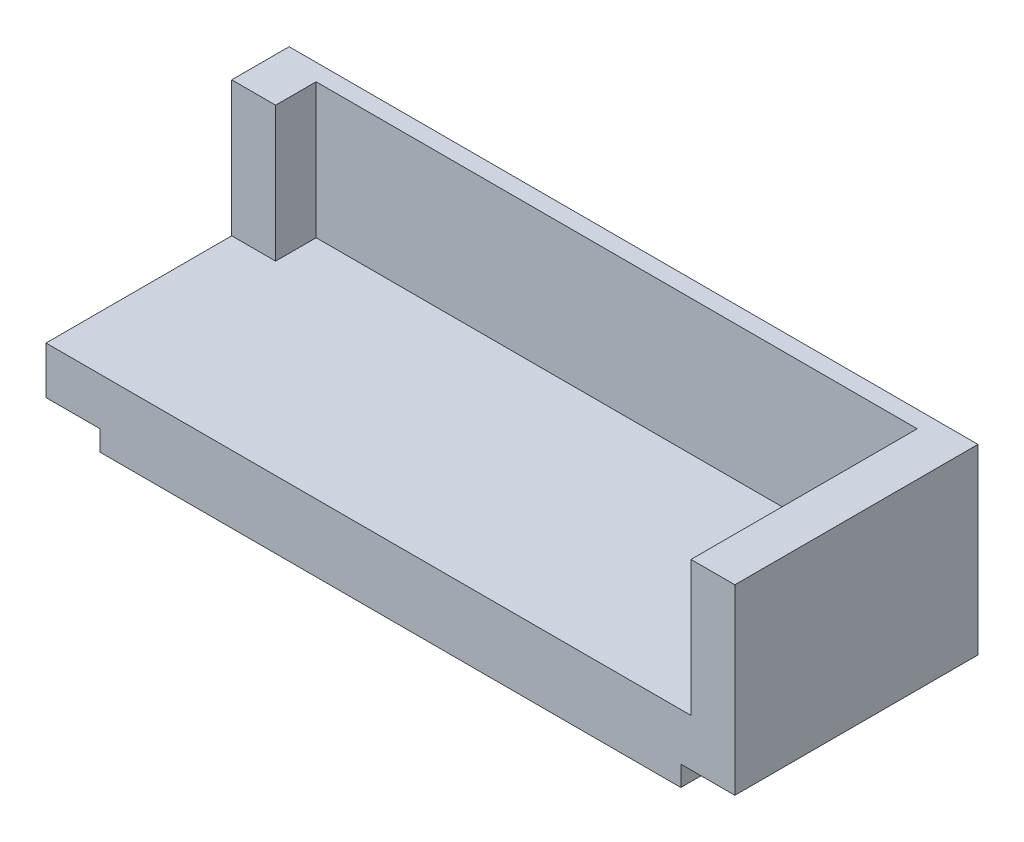
ISO-10303-21;
HEADER;
FILE_DESCRIPTION(('STEP AP214'),'2;1');
FILE_NAME('part.step','',(''),(''),'','','');
FILE_SCHEMA(('AUTOMOTIVE_DESIGN { 1 0 10303 214 1 1 1 1 }'));
ENDSEC;
DATA;
#1=APPLICATION_CONTEXT('core data for automotive mechanical design processes');
#2=APPLICATION_PROTOCOL_DEFINITION('international standard','automotive_design',2000,#1);
#3=PRODUCT_CONTEXT('',#1,'mechanical');
#4=PRODUCT('Part','Part','',(#3));
#5=PRODUCT_RELATED_PRODUCT_CATEGORY('part','',(#4));
#6=PRODUCT_DEFINITION_FORMATION('','',#4);
#7=PRODUCT_DEFINITION_CONTEXT('part definition',#1,'design');
#8=PRODUCT_DEFINITION('design','',#6,#7);
#9=PRODUCT_DEFINITION_SHAPE('','',#8);
#10=(LENGTH_UNIT() NAMED_UNIT(*) SI_UNIT(.MILLI.,.METRE.));
#11=(NAMED_UNIT(*) PLANE_ANGLE_UNIT() SI_UNIT($,.RADIAN.));
#12=(NAMED_UNIT(*) SI_UNIT($,.STERADIAN.) SOLID_ANGLE_UNIT());
#13=UNCERTAINTY_MEASURE_WITH_UNIT(LENGTH_MEASURE(1.E-05),#10,'distance_accuracy_value','');
#14=(GEOMETRIC_REPRESENTATION_CONTEXT(3) GLOBAL_UNCERTAINTY_ASSIGNED_CONTEXT((#13)) GLOBAL_UNIT_ASSIGNED_CONTEXT((#10,
#11,#12)) REPRESENTATION_CONTEXT('',''));
#15=CARTESIAN_POINT('',(0.,0.,0.));
#16=DIRECTION('',(0.,0.,1.));
#17=DIRECTION('',(1.,0.,0.));
#18=AXIS2_PLACEMENT_3D('',#15,#16,#17);
#19=CARTESIAN_POINT('',(0.,3.5,0.));
#20=DIRECTION('',(0.,-1.,0.));
#21=DIRECTION('',(0.,0.,-1.));
#22=AXIS2_PLACEMENT_3D('',#19,#20,#21);
#23=PLANE('',#22);
#24=DIRECTION('',(1.,0.,0.));
#25=VECTOR('',#24,1.);
#26=CARTESIAN_POINT('',(-4.,3.5,-13.75));
#27=LINE('',#26,#25);
#28=CARTESIAN_POINT('',(-4.,3.5,-13.75));
#29=VERTEX_POINT('',#28);
#30=CARTESIAN_POINT('',(-0.75,3.5,-13.75));
#31=VERTEX_POINT('',#30);
#32=EDGE_CURVE('E259',#29,#31,#27,.T.);
#33=ORIENTED_EDGE('',*,*,#32,.F.);
#34=DIRECTION('',(0.,0.,-1.));
#35=VECTOR('',#34,1.);
#36=CARTESIAN_POINT('',(-4.,3.5,0.));
#37=LINE('',#36,#35);
#38=CARTESIAN_POINT('',(-4.,3.5,0.));
#39=VERTEX_POINT('',#38);
#40=EDGE_CURVE('E153',#39,#29,#37,.T.);
#41=ORIENTED_EDGE('',*,*,#40,.F.);
#42=DIRECTION('',(1.,0.,0.));
#43=VECTOR('',#42,1.);
#44=CARTESIAN_POINT('',(43.,3.5,0.));
#45=LINE('',#44,#43);
#46=CARTESIAN_POINT('',(43.75,3.5,0.));
#47=VERTEX_POINT('',#46);
#48=EDGE_CURVE('E208',#39,#47,#45,.T.);
#49=ORIENTED_EDGE('',*,*,#48,.T.);
#50=DIRECTION('',(0.,0.,1.));
#51=VECTOR('',#50,1.);
#52=CARTESIAN_POINT('',(43.75,3.5,-16.75));
#53=LINE('',#52,#51);
#54=CARTESIAN_POINT('',(43.75,3.5,-16.75));
#55=VERTEX_POINT('',#54);
#56=EDGE_CURVE('E154',#55,#47,#53,.T.);
#57=ORIENTED_EDGE('',*,*,#56,.F.);
#58=DIRECTION('',(1.,0.,0.));
#59=VECTOR('',#58,1.);
#60=CARTESIAN_POINT('',(-4.,3.5,-16.75));
#61=LINE('',#60,#59);
#62=CARTESIAN_POINT('',(-0.75,3.5,-16.75));
#63=VERTEX_POINT('',#62);
#64=EDGE_CURVE('E171',#63,#55,#61,.T.);
#65=ORIENTED_EDGE('',*,*,#64,.F.);
#66=DIRECTION('',(0.,0.,-1.));
#67=VECTOR('',#66,1.);
#68=CARTESIAN_POINT('',(-0.75,3.5,-16.75));
#69=LINE('',#68,#67);
#70=EDGE_CURVE('E147',#31,#63,#69,.T.);
#71=ORIENTED_EDGE('',*,*,#70,.F.);
#72=EDGE_LOOP('',(#33,#41,#49,#57,#65,#71));
#73=FACE_BOUND('',#72,.T.);
#74=ADVANCED_FACE('F32',(#73),#23,.F.);
#75=CARTESIAN_POINT('',(-4.,13.5,-16.75));
#76=DIRECTION('',(0.,0.,-1.));
#77=DIRECTION('',(-1.,0.,0.));
#78=AXIS2_PLACEMENT_3D('',#75,#76,#77);
#79=PLANE('',#78);
#80=DIRECTION('',(0.,-1.,0.));
#81=VECTOR('',#80,1.);
#82=CARTESIAN_POINT('',(-0.75,13.5,-16.75));
#83=LINE('',#82,#81);
#84=CARTESIAN_POINT('',(-0.75,13.5,-16.75));
#85=VERTEX_POINT('',#84);
#86=EDGE_CURVE('E49',#85,#63,#83,.T.);
#87=ORIENTED_EDGE('',*,*,#86,.T.);
#88=ORIENTED_EDGE('',*,*,#64,.T.);
#89=DIRECTION('',(0.,-1.,0.));
#90=VECTOR('',#89,1.);
#91=CARTESIAN_POINT('',(43.75,13.5,-16.75));
#92=LINE('',#91,#90);
#93=CARTESIAN_POINT('',(43.75,13.5,-16.75));
#94=VERTEX_POINT('',#93);
#95=EDGE_CURVE('E168',#94,#55,#92,.T.);
#96=ORIENTED_EDGE('',*,*,#95,.F.);
#97=DIRECTION('',(1.,0.,0.));
#98=VECTOR('',#97,1.);
#99=CARTESIAN_POINT('',(-4.,13.5,-16.75));
#100=LINE('',#99,#98);
#101=EDGE_CURVE('E172',#85,#94,#100,.T.);
#102=ORIENTED_EDGE('',*,*,#101,.F.);
#103=EDGE_LOOP('',(#87,#88,#96,#102));
#104=FACE_BOUND('',#103,.T.);
#105=ADVANCED_FACE('F266',(#104),#79,.F.);
#106=CARTESIAN_POINT('',(0.,-1.5,-18.));
#107=DIRECTION('',(-1.,0.,0.));
#108=DIRECTION('',(0.,0.,1.));
#109=AXIS2_PLACEMENT_3D('',#106,#107,#108);
#110=PLANE('',#109);
#111=DIRECTION('',(0.,0.,1.));
#112=VECTOR('',#111,1.);
#113=CARTESIAN_POINT('',(0.,0.,0.));
#114=LINE('',#113,#112);
#115=CARTESIAN_POINT('',(0.,0.,-18.));
#116=VERTEX_POINT('',#115);
#117=CARTESIAN_POINT('',(0.,0.,0.));
#118=VERTEX_POINT('',#117);
#119=EDGE_CURVE('E57',#116,#118,#114,.T.);
#120=ORIENTED_EDGE('',*,*,#119,.F.);
#121=DIRECTION('',(0.,1.,0.));
#122=VECTOR('',#121,1.);
#123=CARTESIAN_POINT('',(0.,-1.5,-18.));
#124=LINE('',#123,#122);
#125=CARTESIAN_POINT('',(0.,-1.5,-18.));
#126=VERTEX_POINT('',#125);
#127=EDGE_CURVE('E11',#126,#116,#124,.T.);
#128=ORIENTED_EDGE('',*,*,#127,.F.);
#129=DIRECTION('',(0.,0.,1.));
#130=VECTOR('',#129,1.);
#131=CARTESIAN_POINT('',(0.,-1.5,-18.));
#132=LINE('',#131,#130);
#133=CARTESIAN_POINT('',(0.,-1.5,0.));
#134=VERTEX_POINT('',#133);
#135=EDGE_CURVE('E211',#126,#134,#132,.T.);
#136=ORIENTED_EDGE('',*,*,#135,.T.);
#137=DIRECTION('',(0.,1.,0.));
#138=VECTOR('',#137,1.);
#139=CARTESIAN_POINT('',(0.,-1.5,0.));
#140=LINE('',#139,#138);
#141=EDGE_CURVE('E36',#134,#118,#140,.T.);
#142=ORIENTED_EDGE('',*,*,#141,.T.);
#143=EDGE_LOOP('',(#120,#128,#136,#142));
#144=FACE_BOUND('',#143,.T.);
#145=ADVANCED_FACE('F34',(#144),#110,.T.);
#146=CARTESIAN_POINT('',(43.,-1.5,-18.));
#147=DIRECTION('',(0.,0.,-1.));
#148=DIRECTION('',(-1.,0.,0.));
#149=AXIS2_PLACEMENT_3D('',#146,#147,#148);
#150=PLANE('',#149);
#151=ORIENTED_EDGE('',*,*,#127,.T.);
#152=DIRECTION('',(1.,0.,0.));
#153=VECTOR('',#152,1.);
#154=CARTESIAN_POINT('',(-4.,0.,-18.));
#155=LINE('',#154,#153);
#156=CARTESIAN_POINT('',(-4.,0.,-18.));
#157=VERTEX_POINT('',#156);
#158=EDGE_CURVE('E189',#157,#116,#155,.T.);
#159=ORIENTED_EDGE('',*,*,#158,.F.);
#160=DIRECTION('',(0.,-1.,0.));
#161=VECTOR('',#160,1.);
#162=CARTESIAN_POINT('',(-4.,0.,-18.));
#163=LINE('',#162,#161);
#164=CARTESIAN_POINT('',(-4.,13.5,-18.));
#165=VERTEX_POINT('',#164);
#166=EDGE_CURVE('E181',#165,#157,#163,.T.);
#167=ORIENTED_EDGE('',*,*,#166,.F.);
#168=DIRECTION('',(-1.,0.,0.));
#169=VECTOR('',#168,1.);
#170=CARTESIAN_POINT('',(-4.,13.5,-18.));
#171=LINE('',#170,#169);
#172=CARTESIAN_POINT('',(47.,13.5,-18.));
#173=VERTEX_POINT('',#172);
#174=EDGE_CURVE('E136',#173,#165,#171,.T.);
#175=ORIENTED_EDGE('',*,*,#174,.F.);
#176=DIRECTION('',(0.,1.,0.));
#177=VECTOR('',#176,1.);
#178=CARTESIAN_POINT('',(47.,0.,-18.));
#179=LINE('',#178,#177);
#180=CARTESIAN_POINT('',(47.,0.,-18.));
#181=VERTEX_POINT('',#180);
#182=EDGE_CURVE('E198',#181,#173,#179,.T.);
#183=ORIENTED_EDGE('',*,*,#182,.F.);
#184=DIRECTION('',(-1.,0.,0.));
#185=VECTOR('',#184,1.);
#186=CARTESIAN_POINT('',(47.,0.,-18.));
#187=LINE('',#186,#185);
#188=CARTESIAN_POINT('',(43.,0.,-18.));
#189=VERTEX_POINT('',#188);
#190=EDGE_CURVE('E200',#181,#189,#187,.T.);
#191=ORIENTED_EDGE('',*,*,#190,.T.);
#192=DIRECTION('',(0.,1.,0.));
#193=VECTOR('',#192,1.);
#194=CARTESIAN_POINT('',(43.,-1.5,-18.));
#195=LINE('',#194,#193);
#196=CARTESIAN_POINT('',(43.,-1.5,-18.));
#197=VERTEX_POINT('',#196);
#198=EDGE_CURVE('E41',#197,#189,#195,.T.);
#199=ORIENTED_EDGE('',*,*,#198,.F.);
#200=DIRECTION('',(-1.,0.,0.));
#201=VECTOR('',#200,1.);
#202=CARTESIAN_POINT('',(43.,-1.5,-18.));
#203=LINE('',#202,#201);
#204=EDGE_CURVE('E220',#197,#126,#203,.T.);
#205=ORIENTED_EDGE('',*,*,#204,.T.);
#206=EDGE_LOOP('',(#151,#159,#167,#175,#183,#191,#199,#205));
#207=FACE_BOUND('',#206,.T.);
#208=ADVANCED_FACE('F237',(#207),#150,.T.);
#209=CARTESIAN_POINT('',(43.,-1.5,-18.));
#210=DIRECTION('',(1.,0.,0.));
#211=DIRECTION('',(0.,0.,-1.));
#212=AXIS2_PLACEMENT_3D('',#209,#210,#211);
#213=PLANE('',#212);
#214=DIRECTION('',(0.,0.,-1.));
#215=VECTOR('',#214,1.);
#216=CARTESIAN_POINT('',(43.,0.,0.));
#217=LINE('',#216,#215);
#218=CARTESIAN_POINT('',(43.,0.,0.));
#219=VERTEX_POINT('',#218);
#220=EDGE_CURVE('E192',#219,#189,#217,.T.);
#221=ORIENTED_EDGE('',*,*,#220,.F.);
#222=DIRECTION('',(0.,1.,0.));
#223=VECTOR('',#222,1.);
#224=CARTESIAN_POINT('',(43.,-1.5,0.));
#225=LINE('',#224,#223);
#226=CARTESIAN_POINT('',(43.,-1.5,0.));
#227=VERTEX_POINT('',#226);
#228=EDGE_CURVE('E223',#227,#219,#225,.T.);
#229=ORIENTED_EDGE('',*,*,#228,.F.);
#230=DIRECTION('',(0.,0.,-1.));
#231=VECTOR('',#230,1.);
#232=CARTESIAN_POINT('',(43.,-1.5,-18.));
#233=LINE('',#232,#231);
#234=EDGE_CURVE('E217',#227,#197,#233,.T.);
#235=ORIENTED_EDGE('',*,*,#234,.T.);
#236=ORIENTED_EDGE('',*,*,#198,.T.);
#237=EDGE_LOOP('',(#221,#229,#235,#236));
#238=FACE_BOUND('',#237,.T.);
#239=ADVANCED_FACE('F243',(#238),#213,.T.);
#240=CARTESIAN_POINT('',(43.,-1.5,0.));
#241=DIRECTION('',(0.,0.,1.));
#242=DIRECTION('',(1.,0.,0.));
#243=AXIS2_PLACEMENT_3D('',#240,#241,#242);
#244=PLANE('',#243);
#245=ORIENTED_EDGE('',*,*,#228,.T.);
#246=DIRECTION('',(-1.,0.,0.));
#247=VECTOR('',#246,1.);
#248=CARTESIAN_POINT('',(47.,0.,0.));
#249=LINE('',#248,#247);
#250=CARTESIAN_POINT('',(47.,0.,0.));
#251=VERTEX_POINT('',#250);
#252=EDGE_CURVE('E205',#251,#219,#249,.T.);
#253=ORIENTED_EDGE('',*,*,#252,.F.);
#254=DIRECTION('',(0.,-1.,0.));
#255=VECTOR('',#254,1.);
#256=CARTESIAN_POINT('',(47.,0.,0.));
#257=LINE('',#256,#255);
#258=CARTESIAN_POINT('',(47.,13.5,0.));
#259=VERTEX_POINT('',#258);
#260=EDGE_CURVE('E193',#259,#251,#257,.T.);
#261=ORIENTED_EDGE('',*,*,#260,.F.);
#262=DIRECTION('',(1.,0.,0.));
#263=VECTOR('',#262,1.);
#264=CARTESIAN_POINT('',(47.,13.5,0.));
#265=LINE('',#264,#263);
#266=CARTESIAN_POINT('',(43.75,13.5,0.));
#267=VERTEX_POINT('',#266);
#268=EDGE_CURVE('E162',#267,#259,#265,.T.);
#269=ORIENTED_EDGE('',*,*,#268,.F.);
#270=DIRECTION('',(0.,-1.,0.));
#271=VECTOR('',#270,1.);
#272=CARTESIAN_POINT('',(43.75,13.5,0.));
#273=LINE('',#272,#271);
#274=EDGE_CURVE('E164',#267,#47,#273,.T.);
#275=ORIENTED_EDGE('',*,*,#274,.T.);
#276=ORIENTED_EDGE('',*,*,#48,.F.);
#277=DIRECTION('',(0.,1.,0.));
#278=VECTOR('',#277,1.);
#279=CARTESIAN_POINT('',(-4.,0.,0.));
#280=LINE('',#279,#278);
#281=CARTESIAN_POINT('',(-4.,0.,0.));
#282=VERTEX_POINT('',#281);
#283=EDGE_CURVE('E178',#282,#39,#280,.T.);
#284=ORIENTED_EDGE('',*,*,#283,.F.);
#285=DIRECTION('',(1.,0.,0.));
#286=VECTOR('',#285,1.);
#287=CARTESIAN_POINT('',(-4.,0.,0.));
#288=LINE('',#287,#286);
#289=EDGE_CURVE('E185',#282,#118,#288,.T.);
#290=ORIENTED_EDGE('',*,*,#289,.T.);
#291=ORIENTED_EDGE('',*,*,#141,.F.);
#292=DIRECTION('',(1.,0.,0.));
#293=VECTOR('',#292,1.);
#294=CARTESIAN_POINT('',(43.,-1.5,0.));
#295=LINE('',#294,#293);
#296=EDGE_CURVE('E214',#134,#227,#295,.T.);
#297=ORIENTED_EDGE('',*,*,#296,.T.);
#298=EDGE_LOOP('',(#245,#253,#261,#269,#275,#276,#284,#290,#291,#297));
#299=FACE_BOUND('',#298,.T.);
#300=ADVANCED_FACE('F235',(#299),#244,.T.);
#301=CARTESIAN_POINT('',(0.,-1.5,0.));
#302=DIRECTION('',(0.,-1.,0.));
#303=DIRECTION('',(0.,0.,-1.));
#304=AXIS2_PLACEMENT_3D('',#301,#302,#303);
#305=PLANE('',#304);
#306=ORIENTED_EDGE('',*,*,#135,.F.);
#307=ORIENTED_EDGE('',*,*,#204,.F.);
#308=ORIENTED_EDGE('',*,*,#234,.F.);
#309=ORIENTED_EDGE('',*,*,#296,.F.);
#310=EDGE_LOOP('',(#306,#307,#308,#309));
#311=FACE_BOUND('',#310,.T.);
#312=ADVANCED_FACE('F240',(#311),#305,.T.);
#313=CARTESIAN_POINT('',(47.,0.,0.));
#314=DIRECTION('',(0.,1.,0.));
#315=DIRECTION('',(0.,0.,1.));
#316=AXIS2_PLACEMENT_3D('',#313,#314,#315);
#317=PLANE('',#316);
#318=ORIENTED_EDGE('',*,*,#220,.T.);
#319=ORIENTED_EDGE('',*,*,#190,.F.);
#320=DIRECTION('',(0.,0.,-1.));
#321=VECTOR('',#320,1.);
#322=CARTESIAN_POINT('',(47.,0.,0.));
#323=LINE('',#322,#321);
#324=EDGE_CURVE('E196',#251,#181,#323,.T.);
#325=ORIENTED_EDGE('',*,*,#324,.F.);
#326=ORIENTED_EDGE('',*,*,#252,.T.);
#327=EDGE_LOOP('',(#318,#319,#325,#326));
#328=FACE_BOUND('',#327,.T.);
#329=ADVANCED_FACE('F246',(#328),#317,.F.);
#330=CARTESIAN_POINT('',(47.,0.,0.));
#331=DIRECTION('',(-1.,0.,0.));
#332=DIRECTION('',(0.,0.,1.));
#333=AXIS2_PLACEMENT_3D('',#330,#331,#332);
#334=PLANE('',#333);
#335=DIRECTION('',(0.,0.,-1.));
#336=VECTOR('',#335,1.);
#337=CARTESIAN_POINT('',(47.,13.5,-18.));
#338=LINE('',#337,#336);
#339=EDGE_CURVE('E174',#259,#173,#338,.T.);
#340=ORIENTED_EDGE('',*,*,#339,.F.);
#341=ORIENTED_EDGE('',*,*,#260,.T.);
#342=ORIENTED_EDGE('',*,*,#324,.T.);
#343=ORIENTED_EDGE('',*,*,#182,.T.);
#344=EDGE_LOOP('',(#340,#341,#342,#343));
#345=FACE_BOUND('',#344,.T.);
#346=ADVANCED_FACE('F250',(#345),#334,.F.);
#347=CARTESIAN_POINT('',(-4.,0.,0.));
#348=DIRECTION('',(0.,1.,0.));
#349=DIRECTION('',(0.,0.,1.));
#350=AXIS2_PLACEMENT_3D('',#347,#348,#349);
#351=PLANE('',#350);
#352=ORIENTED_EDGE('',*,*,#119,.T.);
#353=ORIENTED_EDGE('',*,*,#289,.F.);
#354=DIRECTION('',(0.,0.,1.));
#355=VECTOR('',#354,1.);
#356=CARTESIAN_POINT('',(-4.,0.,0.));
#357=LINE('',#356,#355);
#358=EDGE_CURVE('E183',#157,#282,#357,.T.);
#359=ORIENTED_EDGE('',*,*,#358,.F.);
#360=ORIENTED_EDGE('',*,*,#158,.T.);
#361=EDGE_LOOP('',(#352,#353,#359,#360));
#362=FACE_BOUND('',#361,.T.);
#363=ADVANCED_FACE('F231',(#362),#351,.F.);
#364=CARTESIAN_POINT('',(-4.,0.,0.));
#365=DIRECTION('',(-1.,0.,0.));
#366=DIRECTION('',(0.,0.,1.));
#367=AXIS2_PLACEMENT_3D('',#364,#365,#366);
#368=PLANE('',#367);
#369=ORIENTED_EDGE('',*,*,#283,.T.);
#370=ORIENTED_EDGE('',*,*,#40,.T.);
#371=DIRECTION('',(0.,-1.,0.));
#372=VECTOR('',#371,1.);
#373=CARTESIAN_POINT('',(-4.,13.5,-13.75));
#374=LINE('',#373,#372);
#375=CARTESIAN_POINT('',(-4.,13.5,-13.75));
#376=VERTEX_POINT('',#375);
#377=EDGE_CURVE('E142',#376,#29,#374,.T.);
#378=ORIENTED_EDGE('',*,*,#377,.F.);
#379=DIRECTION('',(0.,0.,1.));
#380=VECTOR('',#379,1.);
#381=CARTESIAN_POINT('',(-4.,13.5,-18.));
#382=LINE('',#381,#380);
#383=EDGE_CURVE('E129',#165,#376,#382,.T.);
#384=ORIENTED_EDGE('',*,*,#383,.F.);
#385=ORIENTED_EDGE('',*,*,#166,.T.);
#386=ORIENTED_EDGE('',*,*,#358,.T.);
#387=EDGE_LOOP('',(#369,#370,#378,#384,#385,#386));
#388=FACE_BOUND('',#387,.T.);
#389=ADVANCED_FACE('F151',(#388),#368,.T.);
#390=CARTESIAN_POINT('',(0.,13.5,0.));
#391=DIRECTION('',(0.,-1.,0.));
#392=DIRECTION('',(0.,0.,-1.));
#393=AXIS2_PLACEMENT_3D('',#390,#391,#392);
#394=PLANE('',#393);
#395=ORIENTED_EDGE('',*,*,#383,.T.);
#396=DIRECTION('',(1.,0.,0.));
#397=VECTOR('',#396,1.);
#398=CARTESIAN_POINT('',(-4.,13.5,-13.75));
#399=LINE('',#398,#397);
#400=CARTESIAN_POINT('',(-0.75,13.5,-13.75));
#401=VERTEX_POINT('',#400);
#402=EDGE_CURVE('E132',#376,#401,#399,.T.);
#403=ORIENTED_EDGE('',*,*,#402,.T.);
#404=DIRECTION('',(0.,0.,-1.));
#405=VECTOR('',#404,1.);
#406=CARTESIAN_POINT('',(-0.75,13.5,-16.75));
#407=LINE('',#406,#405);
#408=EDGE_CURVE('E146',#401,#85,#407,.T.);
#409=ORIENTED_EDGE('',*,*,#408,.T.);
#410=ORIENTED_EDGE('',*,*,#101,.T.);
#411=DIRECTION('',(0.,0.,1.));
#412=VECTOR('',#411,1.);
#413=CARTESIAN_POINT('',(43.75,13.5,-16.75));
#414=LINE('',#413,#412);
#415=EDGE_CURVE('E156',#94,#267,#414,.T.);
#416=ORIENTED_EDGE('',*,*,#415,.T.);
#417=ORIENTED_EDGE('',*,*,#268,.T.);
#418=ORIENTED_EDGE('',*,*,#339,.T.);
#419=ORIENTED_EDGE('',*,*,#174,.T.);
#420=EDGE_LOOP('',(#395,#403,#409,#410,#416,#417,#418,#419));
#421=FACE_BOUND('',#420,.T.);
#422=ADVANCED_FACE('F131',(#421),#394,.F.);
#423=CARTESIAN_POINT('',(43.75,13.5,-16.75));
#424=DIRECTION('',(1.,0.,0.));
#425=DIRECTION('',(0.,0.,-1.));
#426=AXIS2_PLACEMENT_3D('',#423,#424,#425);
#427=PLANE('',#426);
#428=ORIENTED_EDGE('',*,*,#56,.T.);
#429=ORIENTED_EDGE('',*,*,#274,.F.);
#430=ORIENTED_EDGE('',*,*,#415,.F.);
#431=ORIENTED_EDGE('',*,*,#95,.T.);
#432=EDGE_LOOP('',(#428,#429,#430,#431));
#433=FACE_BOUND('',#432,.T.);
#434=ADVANCED_FACE('F267',(#433),#427,.F.);
#435=CARTESIAN_POINT('',(-4.,13.5,-13.75));
#436=DIRECTION('',(0.,0.,-1.));
#437=DIRECTION('',(-1.,0.,0.));
#438=AXIS2_PLACEMENT_3D('',#435,#436,#437);
#439=PLANE('',#438);
#440=ORIENTED_EDGE('',*,*,#32,.T.);
#441=DIRECTION('',(0.,-1.,0.));
#442=VECTOR('',#441,1.);
#443=CARTESIAN_POINT('',(-0.75,13.5,-13.75));
#444=LINE('',#443,#442);
#445=EDGE_CURVE('E145',#401,#31,#444,.T.);
#446=ORIENTED_EDGE('',*,*,#445,.F.);
#447=ORIENTED_EDGE('',*,*,#402,.F.);
#448=ORIENTED_EDGE('',*,*,#377,.T.);
#449=EDGE_LOOP('',(#440,#446,#447,#448));
#450=FACE_BOUND('',#449,.T.);
#451=ADVANCED_FACE('F141',(#450),#439,.F.);
#452=CARTESIAN_POINT('',(-0.75,13.5,-16.75));
#453=DIRECTION('',(-1.,0.,0.));
#454=DIRECTION('',(0.,0.,1.));
#455=AXIS2_PLACEMENT_3D('',#452,#453,#454);
#456=PLANE('',#455);
#457=ORIENTED_EDGE('',*,*,#70,.T.);
#458=ORIENTED_EDGE('',*,*,#86,.F.);
#459=ORIENTED_EDGE('',*,*,#408,.F.);
#460=ORIENTED_EDGE('',*,*,#445,.T.);
#461=EDGE_LOOP('',(#457,#458,#459,#460));
#462=FACE_BOUND('',#461,.T.);
#463=ADVANCED_FACE('F274',(#462),#456,.F.);
#464=CLOSED_SHELL('',(#74,#105,#145,#208,#239,#300,#312,#329,#346,#363,#389,#422,#434,#451,#463));
#465=MANIFOLD_SOLID_BREP('B2',#464);
#466=ADVANCED_BREP_SHAPE_REPRESENTATION('',(#18,#465),#14);
#467=SHAPE_DEFINITION_REPRESENTATION(#9,#466);
ENDSEC;
END-ISO-10303-21;
